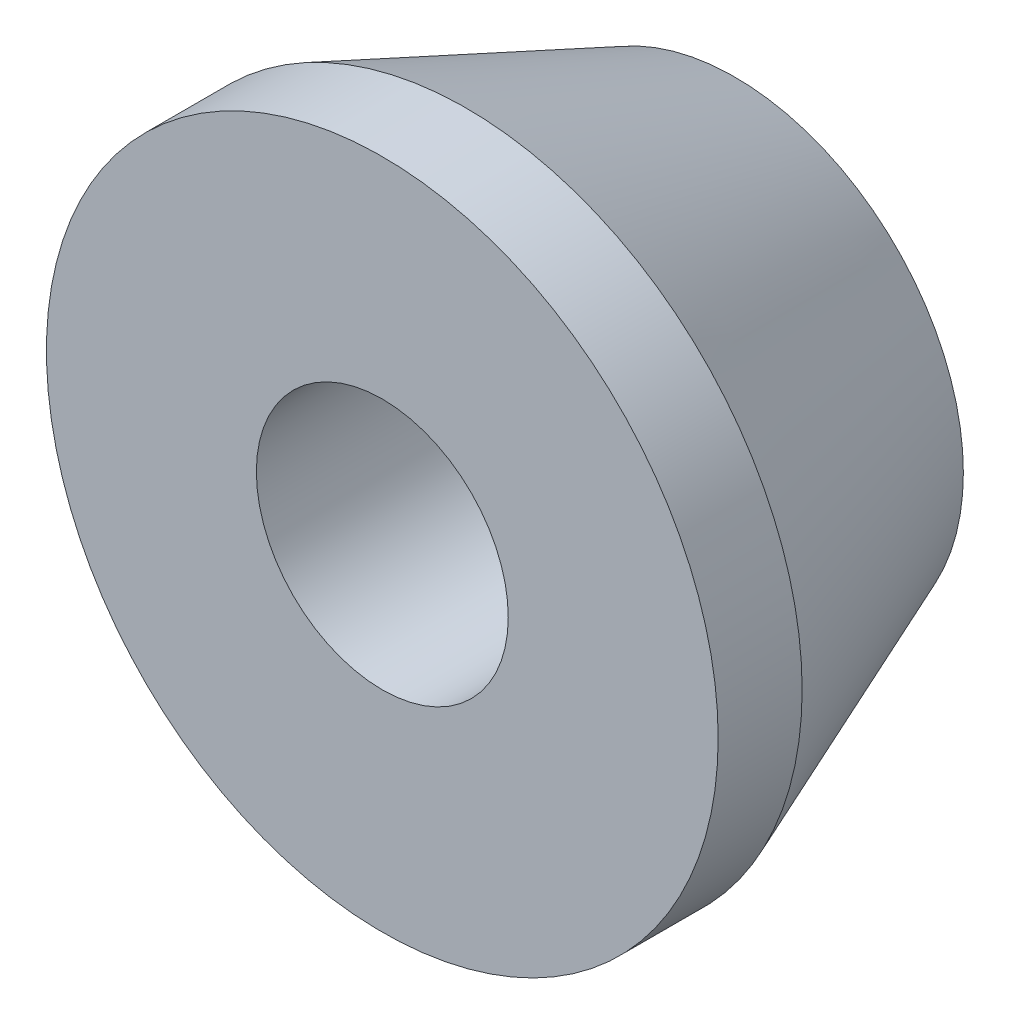
ISO-10303-21;
HEADER;
FILE_DESCRIPTION(('STEP AP214'),'2;1');
FILE_NAME('part.step','',(''),(''),'','','');
FILE_SCHEMA(('AUTOMOTIVE_DESIGN { 1 0 10303 214 1 1 1 1 }'));
ENDSEC;
DATA;
#1=APPLICATION_CONTEXT('core data for automotive mechanical design processes');
#2=APPLICATION_PROTOCOL_DEFINITION('international standard','automotive_design',2000,#1);
#3=PRODUCT_CONTEXT('',#1,'mechanical');
#4=PRODUCT('Part','Part','',(#3));
#5=PRODUCT_RELATED_PRODUCT_CATEGORY('part','',(#4));
#6=PRODUCT_DEFINITION_FORMATION('','',#4);
#7=PRODUCT_DEFINITION_CONTEXT('part definition',#1,'design');
#8=PRODUCT_DEFINITION('design','',#6,#7);
#9=PRODUCT_DEFINITION_SHAPE('','',#8);
#10=(LENGTH_UNIT() NAMED_UNIT(*) SI_UNIT(.MILLI.,.METRE.));
#11=(NAMED_UNIT(*) PLANE_ANGLE_UNIT() SI_UNIT($,.RADIAN.));
#12=(NAMED_UNIT(*) SI_UNIT($,.STERADIAN.) SOLID_ANGLE_UNIT());
#13=UNCERTAINTY_MEASURE_WITH_UNIT(LENGTH_MEASURE(1.E-05),#10,'distance_accuracy_value','');
#14=(GEOMETRIC_REPRESENTATION_CONTEXT(3) GLOBAL_UNCERTAINTY_ASSIGNED_CONTEXT((#13)) GLOBAL_UNIT_ASSIGNED_CONTEXT((#10,
#11,#12)) REPRESENTATION_CONTEXT('',''));
#15=CARTESIAN_POINT('',(0.,0.,0.));
#16=DIRECTION('',(0.,0.,1.));
#17=DIRECTION('',(1.,0.,0.));
#18=AXIS2_PLACEMENT_3D('',#15,#16,#17);
#19=CARTESIAN_POINT('',(0.,0.,0.));
#20=DIRECTION('',(0.,0.,-1.));
#21=DIRECTION('',(-1.,0.,0.));
#22=AXIS2_PLACEMENT_3D('',#19,#20,#21);
#23=PLANE('',#22);
#24=CARTESIAN_POINT('',(0.,0.,0.));
#25=DIRECTION('',(0.,0.,1.));
#26=DIRECTION('',(1.,0.,0.));
#27=AXIS2_PLACEMENT_3D('',#24,#25,#26);
#28=CIRCLE('',#27,4.7625);
#29=CARTESIAN_POINT('',(4.7625,0.,0.));
#30=VERTEX_POINT('',#29);
#31=EDGE_CURVE('E53',#30,#30,#28,.T.);
#32=ORIENTED_EDGE('',*,*,#31,.F.);
#33=EDGE_LOOP('',(#32));
#34=FACE_BOUND('',#33,.T.);
#35=CARTESIAN_POINT('',(0.,0.,0.));
#36=DIRECTION('',(0.,0.,1.));
#37=DIRECTION('',(1.,0.,0.));
#38=AXIS2_PLACEMENT_3D('',#35,#36,#37);
#39=CIRCLE('',#38,12.7);
#40=CARTESIAN_POINT('',(12.7,0.,0.));
#41=VERTEX_POINT('',#40);
#42=EDGE_CURVE('E10',#41,#41,#39,.T.);
#43=ORIENTED_EDGE('',*,*,#42,.T.);
#44=EDGE_LOOP('',(#43));
#45=FACE_BOUND('',#44,.T.);
#46=ADVANCED_FACE('F34',(#34,#45),#23,.F.);
#47=CARTESIAN_POINT('',(0.,0.,0.));
#48=DIRECTION('',(0.,0.,1.));
#49=DIRECTION('',(1.,0.,0.));
#50=AXIS2_PLACEMENT_3D('',#47,#48,#49);
#51=CYLINDRICAL_SURFACE('',#50,12.7);
#52=ORIENTED_EDGE('',*,*,#42,.F.);
#53=EDGE_LOOP('',(#52));
#54=FACE_BOUND('',#53,.T.);
#55=CARTESIAN_POINT('',(0.,0.,-3.175));
#56=DIRECTION('',(0.,0.,1.));
#57=DIRECTION('',(1.,0.,0.));
#58=AXIS2_PLACEMENT_3D('',#55,#56,#57);
#59=CIRCLE('',#58,12.7);
#60=CARTESIAN_POINT('',(12.7,0.,-3.175));
#61=VERTEX_POINT('',#60);
#62=EDGE_CURVE('E40',#61,#61,#59,.T.);
#63=ORIENTED_EDGE('',*,*,#62,.T.);
#64=EDGE_LOOP('',(#63));
#65=FACE_BOUND('',#64,.T.);
#66=ADVANCED_FACE('F60',(#54,#65),#51,.T.);
#67=CARTESIAN_POINT('',(0.,0.,-13.335));
#68=DIRECTION('',(0.,0.,1.));
#69=DIRECTION('',(1.,0.,0.));
#70=AXIS2_PLACEMENT_3D('',#67,#68,#69);
#71=CONICAL_SURFACE('',#70,8.636,0.380506377112365);
#72=ORIENTED_EDGE('',*,*,#62,.F.);
#73=EDGE_LOOP('',(#72));
#74=FACE_BOUND('',#73,.T.);
#75=CARTESIAN_POINT('',(0.,0.,-13.335));
#76=DIRECTION('',(0.,0.,1.));
#77=DIRECTION('',(1.,0.,0.));
#78=AXIS2_PLACEMENT_3D('',#75,#76,#77);
#79=CIRCLE('',#78,8.636);
#80=CARTESIAN_POINT('',(8.636,0.,-13.335));
#81=VERTEX_POINT('',#80);
#82=EDGE_CURVE('E44',#81,#81,#79,.T.);
#83=ORIENTED_EDGE('',*,*,#82,.T.);
#84=EDGE_LOOP('',(#83));
#85=FACE_BOUND('',#84,.T.);
#86=ADVANCED_FACE('F64',(#74,#85),#71,.T.);
#87=CARTESIAN_POINT('',(0.,0.,-13.335));
#88=DIRECTION('',(0.,0.,1.));
#89=DIRECTION('',(1.,0.,0.));
#90=AXIS2_PLACEMENT_3D('',#87,#88,#89);
#91=PLANE('',#90);
#92=ORIENTED_EDGE('',*,*,#82,.F.);
#93=EDGE_LOOP('',(#92));
#94=FACE_BOUND('',#93,.T.);
#95=CARTESIAN_POINT('',(0.,0.,-13.335));
#96=DIRECTION('',(0.,0.,1.));
#97=DIRECTION('',(1.,0.,0.));
#98=AXIS2_PLACEMENT_3D('',#95,#96,#97);
#99=CIRCLE('',#98,4.7625);
#100=CARTESIAN_POINT('',(4.7625,0.,-13.335));
#101=VERTEX_POINT('',#100);
#102=EDGE_CURVE('E48',#101,#101,#99,.T.);
#103=ORIENTED_EDGE('',*,*,#102,.T.);
#104=EDGE_LOOP('',(#103));
#105=FACE_BOUND('',#104,.T.);
#106=ADVANCED_FACE('F69',(#94,#105),#91,.F.);
#107=CARTESIAN_POINT('',(0.,0.,0.));
#108=DIRECTION('',(0.,0.,1.));
#109=DIRECTION('',(1.,0.,0.));
#110=AXIS2_PLACEMENT_3D('',#107,#108,#109);
#111=CYLINDRICAL_SURFACE('',#110,4.7625);
#112=ORIENTED_EDGE('',*,*,#102,.F.);
#113=EDGE_LOOP('',(#112));
#114=FACE_BOUND('',#113,.T.);
#115=ORIENTED_EDGE('',*,*,#31,.T.);
#116=EDGE_LOOP('',(#115));
#117=FACE_BOUND('',#116,.T.);
#118=ADVANCED_FACE('F57',(#114,#117),#111,.F.);
#119=CLOSED_SHELL('',(#46,#66,#86,#106,#118));
#120=MANIFOLD_SOLID_BREP('B2',#119);
#121=ADVANCED_BREP_SHAPE_REPRESENTATION('',(#18,#120),#14);
#122=SHAPE_DEFINITION_REPRESENTATION(#9,#121);
ENDSEC;
END-ISO-10303-21;
